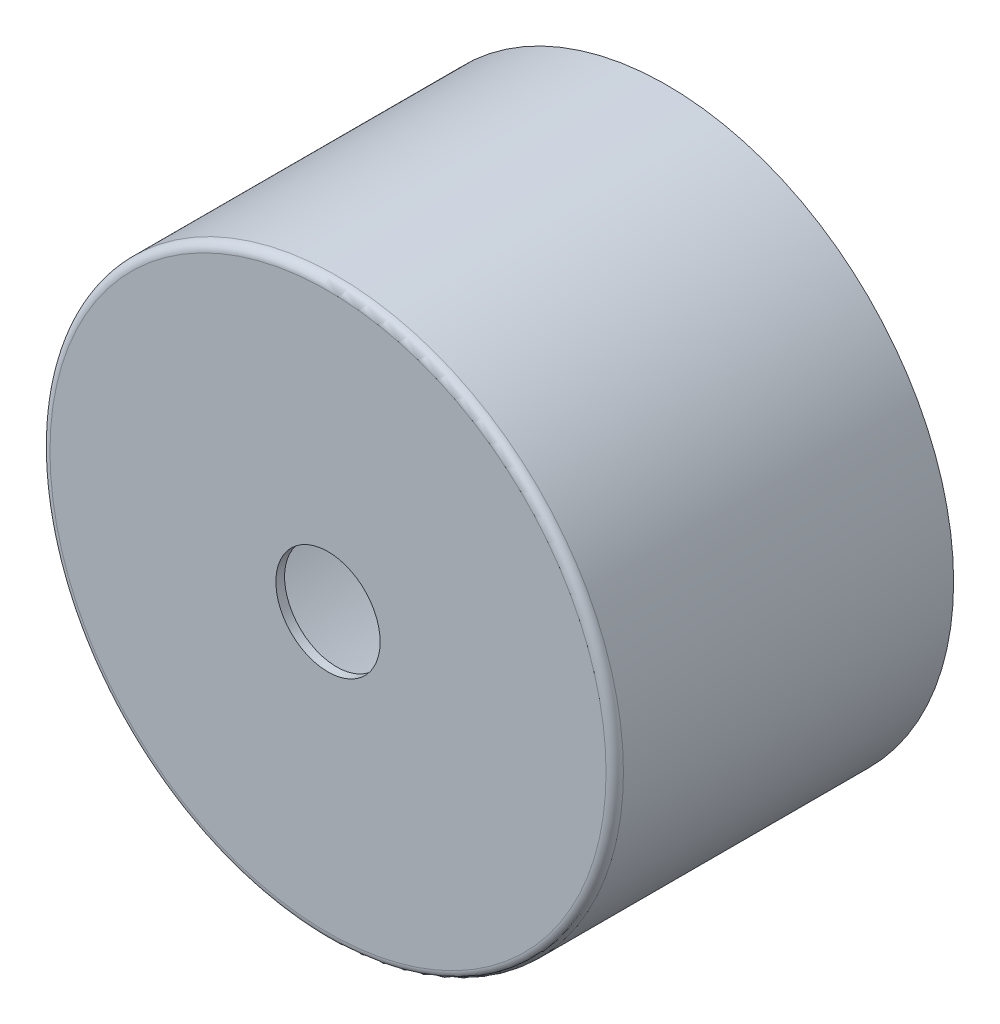
ISO-10303-21;
HEADER;
FILE_DESCRIPTION(('STEP AP214'),'2;1');
FILE_NAME('part.step','',(''),(''),'','','');
FILE_SCHEMA(('AUTOMOTIVE_DESIGN { 1 0 10303 214 1 1 1 1 }'));
ENDSEC;
DATA;
#1=APPLICATION_CONTEXT('core data for automotive mechanical design processes');
#2=APPLICATION_PROTOCOL_DEFINITION('international standard','automotive_design',2000,#1);
#3=PRODUCT_CONTEXT('',#1,'mechanical');
#4=PRODUCT('Part','Part','',(#3));
#5=PRODUCT_RELATED_PRODUCT_CATEGORY('part','',(#4));
#6=PRODUCT_DEFINITION_FORMATION('','',#4);
#7=PRODUCT_DEFINITION_CONTEXT('part definition',#1,'design');
#8=PRODUCT_DEFINITION('design','',#6,#7);
#9=PRODUCT_DEFINITION_SHAPE('','',#8);
#10=(LENGTH_UNIT() NAMED_UNIT(*) SI_UNIT(.MILLI.,.METRE.));
#11=(NAMED_UNIT(*) PLANE_ANGLE_UNIT() SI_UNIT($,.RADIAN.));
#12=(NAMED_UNIT(*) SI_UNIT($,.STERADIAN.) SOLID_ANGLE_UNIT());
#13=UNCERTAINTY_MEASURE_WITH_UNIT(LENGTH_MEASURE(1.E-05),#10,'distance_accuracy_value','');
#14=(GEOMETRIC_REPRESENTATION_CONTEXT(3) GLOBAL_UNCERTAINTY_ASSIGNED_CONTEXT((#13)) GLOBAL_UNIT_ASSIGNED_CONTEXT((#10,
#11,#12)) REPRESENTATION_CONTEXT('',''));
#15=CARTESIAN_POINT('',(0.,0.,0.));
#16=DIRECTION('',(0.,0.,1.));
#17=DIRECTION('',(1.,0.,0.));
#18=AXIS2_PLACEMENT_3D('',#15,#16,#17);
#19=CARTESIAN_POINT('',(0.,0.,-19.5));
#20=DIRECTION('',(0.,0.,1.));
#21=DIRECTION('',(1.,0.,0.));
#22=AXIS2_PLACEMENT_3D('',#19,#20,#21);
#23=CYLINDRICAL_SURFACE('',#22,16.5);
#24=CARTESIAN_POINT('',(0.,0.,-0.5));
#25=DIRECTION('',(0.,0.,1.));
#26=DIRECTION('',(1.,0.,0.));
#27=AXIS2_PLACEMENT_3D('',#24,#25,#26);
#28=CIRCLE('',#27,16.5);
#29=CARTESIAN_POINT('',(16.5,0.,-0.5));
#30=VERTEX_POINT('',#29);
#31=EDGE_CURVE('E10',#30,#30,#28,.F.);
#32=ORIENTED_EDGE('',*,*,#31,.T.);
#33=EDGE_LOOP('',(#32));
#34=FACE_BOUND('',#33,.T.);
#35=CARTESIAN_POINT('',(0.,0.,-19.5));
#36=DIRECTION('',(0.,0.,1.));
#37=DIRECTION('',(1.,0.,0.));
#38=AXIS2_PLACEMENT_3D('',#35,#36,#37);
#39=CIRCLE('',#38,16.5);
#40=CARTESIAN_POINT('',(16.5,0.,-19.5));
#41=VERTEX_POINT('',#40);
#42=EDGE_CURVE('E42',#41,#41,#39,.T.);
#43=ORIENTED_EDGE('',*,*,#42,.T.);
#44=EDGE_LOOP('',(#43));
#45=FACE_BOUND('',#44,.T.);
#46=ADVANCED_FACE('F31',(#34,#45),#23,.T.);
#47=CARTESIAN_POINT('',(0.,0.,-19.5));
#48=DIRECTION('',(0.,0.,1.));
#49=DIRECTION('',(1.,0.,0.));
#50=AXIS2_PLACEMENT_3D('',#47,#48,#49);
#51=PLANE('',#50);
#52=CARTESIAN_POINT('',(0.,0.,-19.5));
#53=DIRECTION('',(0.,0.,1.));
#54=DIRECTION('',(1.,0.,0.));
#55=AXIS2_PLACEMENT_3D('',#52,#53,#54);
#56=CIRCLE('',#55,16.);
#57=CARTESIAN_POINT('',(16.,0.,-19.5));
#58=VERTEX_POINT('',#57);
#59=EDGE_CURVE('E46',#58,#58,#56,.T.);
#60=ORIENTED_EDGE('',*,*,#59,.T.);
#61=EDGE_LOOP('',(#60));
#62=FACE_BOUND('',#61,.T.);
#63=ORIENTED_EDGE('',*,*,#42,.F.);
#64=EDGE_LOOP('',(#63));
#65=FACE_BOUND('',#64,.T.);
#66=ADVANCED_FACE('F67',(#62,#65),#51,.F.);
#67=CARTESIAN_POINT('',(0.,0.,0.));
#68=DIRECTION('',(0.,0.,1.));
#69=DIRECTION('',(1.,0.,0.));
#70=AXIS2_PLACEMENT_3D('',#67,#68,#69);
#71=PLANE('',#70);
#72=CARTESIAN_POINT('',(0.,0.,0.));
#73=DIRECTION('',(0.,0.,1.));
#74=DIRECTION('',(1.,0.,0.));
#75=AXIS2_PLACEMENT_3D('',#72,#73,#74);
#76=CIRCLE('',#75,16.);
#77=CARTESIAN_POINT('',(16.,0.,0.));
#78=VERTEX_POINT('',#77);
#79=EDGE_CURVE('E38',#78,#78,#76,.T.);
#80=ORIENTED_EDGE('',*,*,#79,.T.);
#81=EDGE_LOOP('',(#80));
#82=FACE_BOUND('',#81,.T.);
#83=CARTESIAN_POINT('',(0.,0.,0.));
#84=DIRECTION('',(0.,0.,1.));
#85=DIRECTION('',(1.,0.,0.));
#86=AXIS2_PLACEMENT_3D('',#83,#84,#85);
#87=CIRCLE('',#86,3.);
#88=CARTESIAN_POINT('',(3.,0.,0.));
#89=VERTEX_POINT('',#88);
#90=EDGE_CURVE('E52',#89,#89,#87,.T.);
#91=ORIENTED_EDGE('',*,*,#90,.F.);
#92=EDGE_LOOP('',(#91));
#93=FACE_BOUND('',#92,.T.);
#94=ADVANCED_FACE('F64',(#82,#93),#71,.T.);
#95=CARTESIAN_POINT('',(0.,0.,-19.5));
#96=DIRECTION('',(0.,0.,1.));
#97=DIRECTION('',(1.,0.,0.));
#98=AXIS2_PLACEMENT_3D('',#95,#96,#97);
#99=CYLINDRICAL_SURFACE('',#98,16.);
#100=ORIENTED_EDGE('',*,*,#59,.F.);
#101=EDGE_LOOP('',(#100));
#102=FACE_BOUND('',#101,.T.);
#103=CARTESIAN_POINT('',(0.,0.,-0.5));
#104=DIRECTION('',(0.,0.,1.));
#105=DIRECTION('',(1.,0.,0.));
#106=AXIS2_PLACEMENT_3D('',#103,#104,#105);
#107=CIRCLE('',#106,16.);
#108=CARTESIAN_POINT('',(16.,0.,-0.5));
#109=VERTEX_POINT('',#108);
#110=EDGE_CURVE('E51',#109,#109,#107,.T.);
#111=ORIENTED_EDGE('',*,*,#110,.T.);
#112=EDGE_LOOP('',(#111));
#113=FACE_BOUND('',#112,.T.);
#114=ADVANCED_FACE('F66',(#102,#113),#99,.F.);
#115=CARTESIAN_POINT('',(0.,0.,-0.5));
#116=DIRECTION('',(0.,0.,1.));
#117=DIRECTION('',(1.,0.,0.));
#118=AXIS2_PLACEMENT_3D('',#115,#116,#117);
#119=PLANE('',#118);
#120=CARTESIAN_POINT('',(0.,0.,-0.5));
#121=DIRECTION('',(0.,0.,1.));
#122=DIRECTION('',(1.,0.,0.));
#123=AXIS2_PLACEMENT_3D('',#120,#121,#122);
#124=CIRCLE('',#123,3.);
#125=CARTESIAN_POINT('',(3.,0.,-0.5));
#126=VERTEX_POINT('',#125);
#127=EDGE_CURVE('E49',#126,#126,#124,.T.);
#128=ORIENTED_EDGE('',*,*,#127,.T.);
#129=EDGE_LOOP('',(#128));
#130=FACE_BOUND('',#129,.T.);
#131=ORIENTED_EDGE('',*,*,#110,.F.);
#132=EDGE_LOOP('',(#131));
#133=FACE_BOUND('',#132,.T.);
#134=ADVANCED_FACE('F74',(#130,#133),#119,.F.);
#135=CARTESIAN_POINT('',(0.,0.,-19.5));
#136=DIRECTION('',(0.,0.,1.));
#137=DIRECTION('',(1.,0.,0.));
#138=AXIS2_PLACEMENT_3D('',#135,#136,#137);
#139=CYLINDRICAL_SURFACE('',#138,3.);
#140=ORIENTED_EDGE('',*,*,#90,.T.);
#141=EDGE_LOOP('',(#140));
#142=FACE_BOUND('',#141,.T.);
#143=ORIENTED_EDGE('',*,*,#127,.F.);
#144=EDGE_LOOP('',(#143));
#145=FACE_BOUND('',#144,.T.);
#146=ADVANCED_FACE('F61',(#142,#145),#139,.F.);
#147=CARTESIAN_POINT('',(0.,0.,-0.5));
#148=DIRECTION('',(0.,0.,1.));
#149=DIRECTION('',(1.,0.,0.));
#150=AXIS2_PLACEMENT_3D('',#147,#148,#149);
#151=TOROIDAL_SURFACE('',#150,16.,0.5);
#152=ORIENTED_EDGE('',*,*,#31,.F.);
#153=EDGE_LOOP('',(#152));
#154=FACE_BOUND('',#153,.T.);
#155=ORIENTED_EDGE('',*,*,#79,.F.);
#156=EDGE_LOOP('',(#155));
#157=FACE_BOUND('',#156,.T.);
#158=ADVANCED_FACE('F33',(#154,#157),#151,.T.);
#159=CLOSED_SHELL('',(#46,#66,#94,#114,#134,#146,#158));
#160=MANIFOLD_SOLID_BREP('B2',#159);
#161=ADVANCED_BREP_SHAPE_REPRESENTATION('',(#18,#160),#14);
#162=SHAPE_DEFINITION_REPRESENTATION(#9,#161);
ENDSEC;
END-ISO-10303-21;
